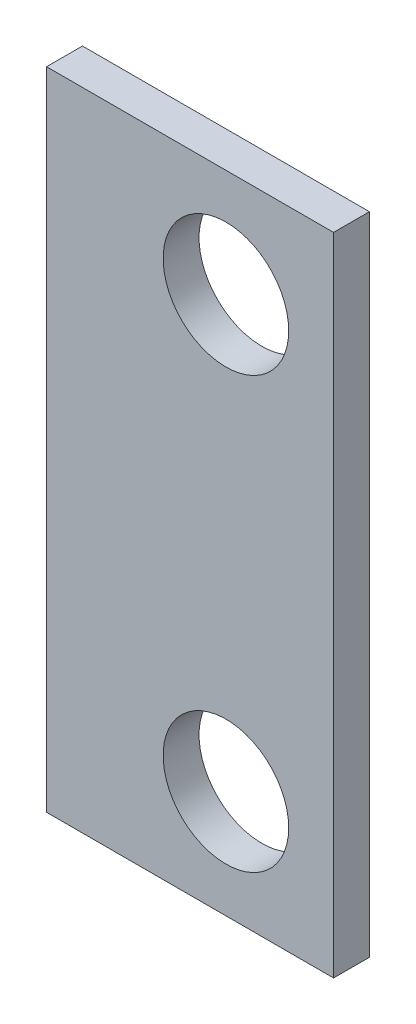
ISO-10303-21;
HEADER;
FILE_DESCRIPTION(('STEP AP214'),'2;1');
FILE_NAME('part.step','',(''),(''),'','','');
FILE_SCHEMA(('AUTOMOTIVE_DESIGN { 1 0 10303 214 1 1 1 1 }'));
ENDSEC;
DATA;
#1=APPLICATION_CONTEXT('core data for automotive mechanical design processes');
#2=APPLICATION_PROTOCOL_DEFINITION('international standard','automotive_design',2000,#1);
#3=PRODUCT_CONTEXT('',#1,'mechanical');
#4=PRODUCT('Part','Part','',(#3));
#5=PRODUCT_RELATED_PRODUCT_CATEGORY('part','',(#4));
#6=PRODUCT_DEFINITION_FORMATION('','',#4);
#7=PRODUCT_DEFINITION_CONTEXT('part definition',#1,'design');
#8=PRODUCT_DEFINITION('design','',#6,#7);
#9=PRODUCT_DEFINITION_SHAPE('','',#8);
#10=(LENGTH_UNIT() NAMED_UNIT(*) SI_UNIT(.MILLI.,.METRE.));
#11=(NAMED_UNIT(*) PLANE_ANGLE_UNIT() SI_UNIT($,.RADIAN.));
#12=(NAMED_UNIT(*) SI_UNIT($,.STERADIAN.) SOLID_ANGLE_UNIT());
#13=UNCERTAINTY_MEASURE_WITH_UNIT(LENGTH_MEASURE(1.E-05),#10,'distance_accuracy_value','');
#14=(GEOMETRIC_REPRESENTATION_CONTEXT(3) GLOBAL_UNCERTAINTY_ASSIGNED_CONTEXT((#13)) GLOBAL_UNIT_ASSIGNED_CONTEXT((#10,
#11,#12)) REPRESENTATION_CONTEXT('',''));
#15=CARTESIAN_POINT('',(0.,0.,0.));
#16=DIRECTION('',(0.,0.,1.));
#17=DIRECTION('',(1.,0.,0.));
#18=AXIS2_PLACEMENT_3D('',#15,#16,#17);
#19=CARTESIAN_POINT('',(0.,114.3,0.));
#20=DIRECTION('',(1.,0.,0.));
#21=DIRECTION('',(0.,0.,-1.));
#22=AXIS2_PLACEMENT_3D('',#19,#20,#21);
#23=PLANE('',#22);
#24=DIRECTION('',(0.,0.,1.));
#25=VECTOR('',#24,1.);
#26=CARTESIAN_POINT('',(0.,0.,0.));
#27=LINE('',#26,#25);
#28=CARTESIAN_POINT('',(0.,0.,-6.35));
#29=VERTEX_POINT('',#28);
#30=CARTESIAN_POINT('',(0.,0.,0.));
#31=VERTEX_POINT('',#30);
#32=EDGE_CURVE('E80',#29,#31,#27,.T.);
#33=ORIENTED_EDGE('',*,*,#32,.T.);
#34=DIRECTION('',(0.,-1.,0.));
#35=VECTOR('',#34,1.);
#36=CARTESIAN_POINT('',(0.,114.3,0.));
#37=LINE('',#36,#35);
#38=CARTESIAN_POINT('',(0.,114.3,0.));
#39=VERTEX_POINT('',#38);
#40=EDGE_CURVE('E11',#39,#31,#37,.T.);
#41=ORIENTED_EDGE('',*,*,#40,.F.);
#42=DIRECTION('',(0.,0.,1.));
#43=VECTOR('',#42,1.);
#44=CARTESIAN_POINT('',(0.,114.3,0.));
#45=LINE('',#44,#43);
#46=CARTESIAN_POINT('',(0.,114.3,-6.35));
#47=VERTEX_POINT('',#46);
#48=EDGE_CURVE('E68',#47,#39,#45,.T.);
#49=ORIENTED_EDGE('',*,*,#48,.F.);
#50=DIRECTION('',(0.,-1.,0.));
#51=VECTOR('',#50,1.);
#52=CARTESIAN_POINT('',(0.,114.3,-6.35));
#53=LINE('',#52,#51);
#54=EDGE_CURVE('E76',#47,#29,#53,.T.);
#55=ORIENTED_EDGE('',*,*,#54,.T.);
#56=EDGE_LOOP('',(#33,#41,#49,#55));
#57=FACE_BOUND('',#56,.T.);
#58=ADVANCED_FACE('F17',(#57),#23,.F.);
#59=CARTESIAN_POINT('',(0.,114.3,0.));
#60=DIRECTION('',(0.,0.,-1.));
#61=DIRECTION('',(-1.,0.,0.));
#62=AXIS2_PLACEMENT_3D('',#59,#60,#61);
#63=PLANE('',#62);
#64=CARTESIAN_POINT('',(31.75,19.05,0.));
#65=DIRECTION('',(0.,0.,1.));
#66=DIRECTION('',(1.,0.,0.));
#67=AXIS2_PLACEMENT_3D('',#64,#65,#66);
#68=CIRCLE('',#67,11.1125);
#69=CARTESIAN_POINT('',(42.8625,19.05,0.));
#70=VERTEX_POINT('',#69);
#71=EDGE_CURVE('E100',#70,#70,#68,.T.);
#72=ORIENTED_EDGE('',*,*,#71,.F.);
#73=EDGE_LOOP('',(#72));
#74=FACE_BOUND('',#73,.T.);
#75=CARTESIAN_POINT('',(31.75,95.25,0.));
#76=DIRECTION('',(0.,0.,1.));
#77=DIRECTION('',(1.,0.,0.));
#78=AXIS2_PLACEMENT_3D('',#75,#76,#77);
#79=CIRCLE('',#78,11.1125);
#80=CARTESIAN_POINT('',(42.8625,95.25,0.));
#81=VERTEX_POINT('',#80);
#82=EDGE_CURVE('E94',#81,#81,#79,.T.);
#83=ORIENTED_EDGE('',*,*,#82,.F.);
#84=EDGE_LOOP('',(#83));
#85=FACE_BOUND('',#84,.T.);
#86=DIRECTION('',(1.,0.,0.));
#87=VECTOR('',#86,1.);
#88=CARTESIAN_POINT('',(0.,0.,0.));
#89=LINE('',#88,#87);
#90=CARTESIAN_POINT('',(50.8,0.,0.));
#91=VERTEX_POINT('',#90);
#92=EDGE_CURVE('E72',#31,#91,#89,.T.);
#93=ORIENTED_EDGE('',*,*,#92,.T.);
#94=DIRECTION('',(0.,-1.,0.));
#95=VECTOR('',#94,1.);
#96=CARTESIAN_POINT('',(50.8,114.3,0.));
#97=LINE('',#96,#95);
#98=CARTESIAN_POINT('',(50.8,114.3,0.));
#99=VERTEX_POINT('',#98);
#100=EDGE_CURVE('E25',#99,#91,#97,.T.);
#101=ORIENTED_EDGE('',*,*,#100,.F.);
#102=DIRECTION('',(1.,0.,0.));
#103=VECTOR('',#102,1.);
#104=CARTESIAN_POINT('',(0.,114.3,0.));
#105=LINE('',#104,#103);
#106=EDGE_CURVE('E63',#39,#99,#105,.T.);
#107=ORIENTED_EDGE('',*,*,#106,.F.);
#108=ORIENTED_EDGE('',*,*,#40,.T.);
#109=EDGE_LOOP('',(#93,#101,#107,#108));
#110=FACE_BOUND('',#109,.T.);
#111=ADVANCED_FACE('F71',(#74,#85,#110),#63,.F.);
#112=CARTESIAN_POINT('',(50.8,114.3,0.));
#113=DIRECTION('',(-1.,0.,0.));
#114=DIRECTION('',(0.,0.,1.));
#115=AXIS2_PLACEMENT_3D('',#112,#113,#114);
#116=PLANE('',#115);
#117=DIRECTION('',(0.,0.,-1.));
#118=VECTOR('',#117,1.);
#119=CARTESIAN_POINT('',(50.8,0.,0.));
#120=LINE('',#119,#118);
#121=CARTESIAN_POINT('',(50.8,0.,-6.35));
#122=VERTEX_POINT('',#121);
#123=EDGE_CURVE('E50',#91,#122,#120,.T.);
#124=ORIENTED_EDGE('',*,*,#123,.T.);
#125=DIRECTION('',(0.,-1.,0.));
#126=VECTOR('',#125,1.);
#127=CARTESIAN_POINT('',(50.8,114.3,-6.35));
#128=LINE('',#127,#126);
#129=CARTESIAN_POINT('',(50.8,114.3,-6.35));
#130=VERTEX_POINT('',#129);
#131=EDGE_CURVE('E73',#130,#122,#128,.T.);
#132=ORIENTED_EDGE('',*,*,#131,.F.);
#133=DIRECTION('',(0.,0.,-1.));
#134=VECTOR('',#133,1.);
#135=CARTESIAN_POINT('',(50.8,114.3,0.));
#136=LINE('',#135,#134);
#137=EDGE_CURVE('E66',#99,#130,#136,.T.);
#138=ORIENTED_EDGE('',*,*,#137,.F.);
#139=ORIENTED_EDGE('',*,*,#100,.T.);
#140=EDGE_LOOP('',(#124,#132,#138,#139));
#141=FACE_BOUND('',#140,.T.);
#142=ADVANCED_FACE('F74',(#141),#116,.F.);
#143=CARTESIAN_POINT('',(0.,114.3,-6.35));
#144=DIRECTION('',(0.,0.,1.));
#145=DIRECTION('',(1.,0.,0.));
#146=AXIS2_PLACEMENT_3D('',#143,#144,#145);
#147=PLANE('',#146);
#148=CARTESIAN_POINT('',(31.75,19.05,-6.35));
#149=DIRECTION('',(0.,0.,1.));
#150=DIRECTION('',(1.,0.,0.));
#151=AXIS2_PLACEMENT_3D('',#148,#149,#150);
#152=CIRCLE('',#151,11.1125);
#153=CARTESIAN_POINT('',(42.8625,19.05,-6.35));
#154=VERTEX_POINT('',#153);
#155=EDGE_CURVE('E97',#154,#154,#152,.T.);
#156=ORIENTED_EDGE('',*,*,#155,.T.);
#157=EDGE_LOOP('',(#156));
#158=FACE_BOUND('',#157,.T.);
#159=CARTESIAN_POINT('',(31.75,95.25,-6.35));
#160=DIRECTION('',(0.,0.,1.));
#161=DIRECTION('',(1.,0.,0.));
#162=AXIS2_PLACEMENT_3D('',#159,#160,#161);
#163=CIRCLE('',#162,11.1125);
#164=CARTESIAN_POINT('',(42.8625,95.25,-6.35));
#165=VERTEX_POINT('',#164);
#166=EDGE_CURVE('E83',#165,#165,#163,.T.);
#167=ORIENTED_EDGE('',*,*,#166,.T.);
#168=EDGE_LOOP('',(#167));
#169=FACE_BOUND('',#168,.T.);
#170=DIRECTION('',(-1.,0.,0.));
#171=VECTOR('',#170,1.);
#172=CARTESIAN_POINT('',(0.,0.,-6.35));
#173=LINE('',#172,#171);
#174=EDGE_CURVE('E56',#122,#29,#173,.T.);
#175=ORIENTED_EDGE('',*,*,#174,.T.);
#176=ORIENTED_EDGE('',*,*,#54,.F.);
#177=DIRECTION('',(-1.,0.,0.));
#178=VECTOR('',#177,1.);
#179=CARTESIAN_POINT('',(0.,114.3,-6.35));
#180=LINE('',#179,#178);
#181=EDGE_CURVE('E33',#130,#47,#180,.T.);
#182=ORIENTED_EDGE('',*,*,#181,.F.);
#183=ORIENTED_EDGE('',*,*,#131,.T.);
#184=EDGE_LOOP('',(#175,#176,#182,#183));
#185=FACE_BOUND('',#184,.T.);
#186=ADVANCED_FACE('F88',(#158,#169,#185),#147,.F.);
#187=CARTESIAN_POINT('',(0.,114.3,0.));
#188=DIRECTION('',(0.,-1.,0.));
#189=DIRECTION('',(0.,0.,-1.));
#190=AXIS2_PLACEMENT_3D('',#187,#188,#189);
#191=PLANE('',#190);
#192=ORIENTED_EDGE('',*,*,#48,.T.);
#193=ORIENTED_EDGE('',*,*,#106,.T.);
#194=ORIENTED_EDGE('',*,*,#137,.T.);
#195=ORIENTED_EDGE('',*,*,#181,.T.);
#196=EDGE_LOOP('',(#192,#193,#194,#195));
#197=FACE_BOUND('',#196,.T.);
#198=ADVANCED_FACE('F64',(#197),#191,.F.);
#199=CARTESIAN_POINT('',(0.,0.,0.));
#200=DIRECTION('',(0.,-1.,0.));
#201=DIRECTION('',(0.,0.,-1.));
#202=AXIS2_PLACEMENT_3D('',#199,#200,#201);
#203=PLANE('',#202);
#204=ORIENTED_EDGE('',*,*,#32,.F.);
#205=ORIENTED_EDGE('',*,*,#174,.F.);
#206=ORIENTED_EDGE('',*,*,#123,.F.);
#207=ORIENTED_EDGE('',*,*,#92,.F.);
#208=EDGE_LOOP('',(#204,#205,#206,#207));
#209=FACE_BOUND('',#208,.T.);
#210=ADVANCED_FACE('F91',(#209),#203,.T.);
#211=CARTESIAN_POINT('',(31.75,95.25,-6.35));
#212=DIRECTION('',(0.,0.,1.));
#213=DIRECTION('',(1.,0.,0.));
#214=AXIS2_PLACEMENT_3D('',#211,#212,#213);
#215=CYLINDRICAL_SURFACE('',#214,11.1125);
#216=ORIENTED_EDGE('',*,*,#166,.F.);
#217=EDGE_LOOP('',(#216));
#218=FACE_BOUND('',#217,.T.);
#219=ORIENTED_EDGE('',*,*,#82,.T.);
#220=EDGE_LOOP('',(#219));
#221=FACE_BOUND('',#220,.T.);
#222=ADVANCED_FACE('F111',(#218,#221),#215,.F.);
#223=CARTESIAN_POINT('',(31.75,19.05,-6.35));
#224=DIRECTION('',(0.,0.,1.));
#225=DIRECTION('',(1.,0.,0.));
#226=AXIS2_PLACEMENT_3D('',#223,#224,#225);
#227=CYLINDRICAL_SURFACE('',#226,11.1125);
#228=ORIENTED_EDGE('',*,*,#155,.F.);
#229=EDGE_LOOP('',(#228));
#230=FACE_BOUND('',#229,.T.);
#231=ORIENTED_EDGE('',*,*,#71,.T.);
#232=EDGE_LOOP('',(#231));
#233=FACE_BOUND('',#232,.T.);
#234=ADVANCED_FACE('F108',(#230,#233),#227,.F.);
#235=CLOSED_SHELL('',(#58,#111,#142,#186,#198,#210,#222,#234));
#236=MANIFOLD_SOLID_BREP('B1',#235);
#237=ADVANCED_BREP_SHAPE_REPRESENTATION('',(#18,#236),#14);
#238=SHAPE_DEFINITION_REPRESENTATION(#9,#237);
ENDSEC;
END-ISO-10303-21;
